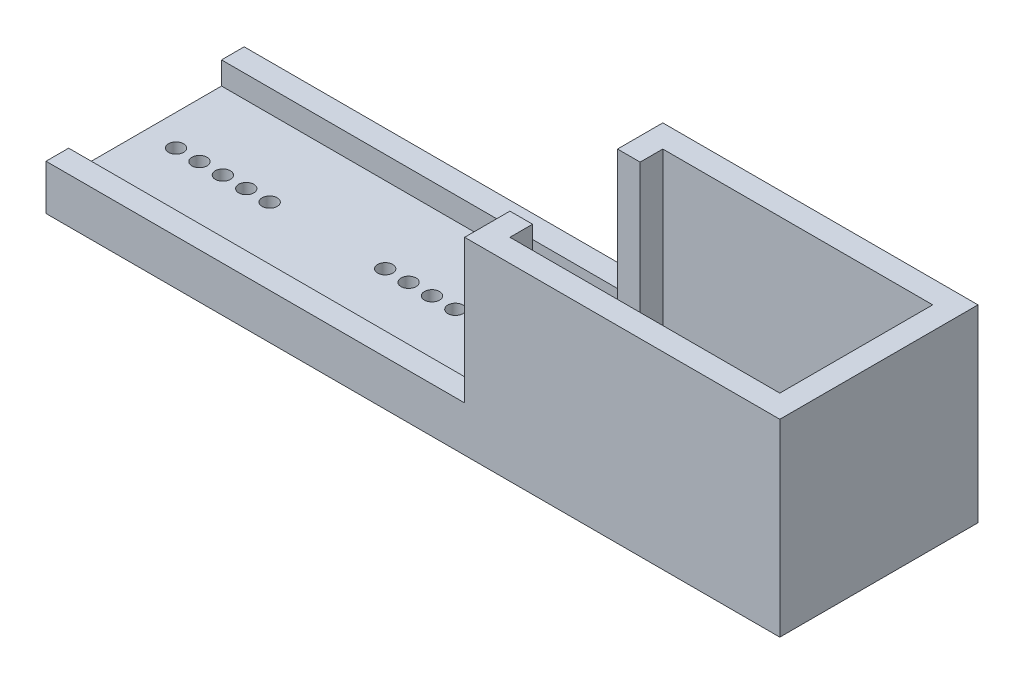
ISO-10303-21;
HEADER;
FILE_DESCRIPTION(('STEP AP214'),'2;1');
FILE_NAME('part.step','',(''),(''),'','','');
FILE_SCHEMA(('AUTOMOTIVE_DESIGN { 1 0 10303 214 1 1 1 1 }'));
ENDSEC;
DATA;
#1=APPLICATION_CONTEXT('core data for automotive mechanical design processes');
#2=APPLICATION_PROTOCOL_DEFINITION('international standard','automotive_design',2000,#1);
#3=PRODUCT_CONTEXT('',#1,'mechanical');
#4=PRODUCT('Part','Part','',(#3));
#5=PRODUCT_RELATED_PRODUCT_CATEGORY('part','',(#4));
#6=PRODUCT_DEFINITION_FORMATION('','',#4);
#7=PRODUCT_DEFINITION_CONTEXT('part definition',#1,'design');
#8=PRODUCT_DEFINITION('design','',#6,#7);
#9=PRODUCT_DEFINITION_SHAPE('','',#8);
#10=(LENGTH_UNIT() NAMED_UNIT(*) SI_UNIT(.MILLI.,.METRE.));
#11=(NAMED_UNIT(*) PLANE_ANGLE_UNIT() SI_UNIT($,.RADIAN.));
#12=(NAMED_UNIT(*) SI_UNIT($,.STERADIAN.) SOLID_ANGLE_UNIT());
#13=UNCERTAINTY_MEASURE_WITH_UNIT(LENGTH_MEASURE(1.E-05),#10,'distance_accuracy_value','');
#14=(GEOMETRIC_REPRESENTATION_CONTEXT(3) GLOBAL_UNCERTAINTY_ASSIGNED_CONTEXT((#13)) GLOBAL_UNIT_ASSIGNED_CONTEXT((#10,
#11,#12)) REPRESENTATION_CONTEXT('',''));
#15=CARTESIAN_POINT('',(0.,0.,0.));
#16=DIRECTION('',(0.,0.,1.));
#17=DIRECTION('',(1.,0.,0.));
#18=AXIS2_PLACEMENT_3D('',#15,#16,#17);
#19=CARTESIAN_POINT('',(0.,3.,0.));
#20=DIRECTION('',(0.,-1.,0.));
#21=DIRECTION('',(0.,0.,-1.));
#22=AXIS2_PLACEMENT_3D('',#19,#20,#21);
#23=PLANE('',#22);
#24=CARTESIAN_POINT('',(-44.5,3.,0.));
#25=DIRECTION('',(0.,1.,0.));
#26=DIRECTION('',(0.,0.,1.));
#27=AXIS2_PLACEMENT_3D('',#24,#25,#26);
#28=CIRCLE('',#27,0.999999999999998);
#29=CARTESIAN_POINT('',(-44.5,3.,1.00000000000009));
#30=VERTEX_POINT('',#29);
#31=EDGE_CURVE('E259',#30,#30,#28,.T.);
#32=ORIENTED_EDGE('',*,*,#31,.F.);
#33=EDGE_LOOP('',(#32));
#34=FACE_BOUND('',#33,.T.);
#35=CARTESIAN_POINT('',(-16.8,3.,0.));
#36=DIRECTION('',(0.,1.,0.));
#37=DIRECTION('',(0.,0.,1.));
#38=AXIS2_PLACEMENT_3D('',#35,#36,#37);
#39=CIRCLE('',#38,1.);
#40=CARTESIAN_POINT('',(-16.8,3.,1.));
#41=VERTEX_POINT('',#40);
#42=EDGE_CURVE('E299',#41,#41,#39,.T.);
#43=ORIENTED_EDGE('',*,*,#42,.F.);
#44=EDGE_LOOP('',(#43));
#45=FACE_BOUND('',#44,.T.);
#46=CARTESIAN_POINT('',(-13.7,3.,0.));
#47=DIRECTION('',(0.,1.,0.));
#48=DIRECTION('',(0.,0.,1.));
#49=AXIS2_PLACEMENT_3D('',#46,#47,#48);
#50=CIRCLE('',#49,1.);
#51=CARTESIAN_POINT('',(-13.7,3.,1.));
#52=VERTEX_POINT('',#51);
#53=EDGE_CURVE('E307',#52,#52,#50,.T.);
#54=ORIENTED_EDGE('',*,*,#53,.F.);
#55=EDGE_LOOP('',(#54));
#56=FACE_BOUND('',#55,.T.);
#57=CARTESIAN_POINT('',(-10.6,3.,0.));
#58=DIRECTION('',(0.,1.,0.));
#59=DIRECTION('',(0.,0.,1.));
#60=AXIS2_PLACEMENT_3D('',#57,#58,#59);
#61=CIRCLE('',#60,1.);
#62=CARTESIAN_POINT('',(-10.6,3.,1.));
#63=VERTEX_POINT('',#62);
#64=EDGE_CURVE('E315',#63,#63,#61,.T.);
#65=ORIENTED_EDGE('',*,*,#64,.F.);
#66=EDGE_LOOP('',(#65));
#67=FACE_BOUND('',#66,.T.);
#68=CARTESIAN_POINT('',(-7.49999999999999,3.,0.));
#69=DIRECTION('',(0.,1.,0.));
#70=DIRECTION('',(0.,0.,1.));
#71=AXIS2_PLACEMENT_3D('',#68,#69,#70);
#72=CIRCLE('',#71,1.);
#73=CARTESIAN_POINT('',(-7.49999999999999,3.,1.));
#74=VERTEX_POINT('',#73);
#75=EDGE_CURVE('E264',#74,#74,#72,.T.);
#76=ORIENTED_EDGE('',*,*,#75,.F.);
#77=EDGE_LOOP('',(#76));
#78=FACE_BOUND('',#77,.T.);
#79=CARTESIAN_POINT('',(-4.39999999999999,3.,0.));
#80=DIRECTION('',(0.,1.,0.));
#81=DIRECTION('',(0.,0.,1.));
#82=AXIS2_PLACEMENT_3D('',#79,#80,#81);
#83=CIRCLE('',#82,1.);
#84=CARTESIAN_POINT('',(-4.39999999999999,3.,1.));
#85=VERTEX_POINT('',#84);
#86=EDGE_CURVE('E265',#85,#85,#83,.T.);
#87=ORIENTED_EDGE('',*,*,#86,.F.);
#88=EDGE_LOOP('',(#87));
#89=FACE_BOUND('',#88,.T.);
#90=CARTESIAN_POINT('',(-35.2,3.,0.));
#91=DIRECTION('',(0.,1.,0.));
#92=DIRECTION('',(0.,0.,1.));
#93=AXIS2_PLACEMENT_3D('',#90,#91,#92);
#94=CIRCLE('',#93,0.999999999999998);
#95=CARTESIAN_POINT('',(-35.2,3.,1.00000000000002));
#96=VERTEX_POINT('',#95);
#97=EDGE_CURVE('E273',#96,#96,#94,.T.);
#98=ORIENTED_EDGE('',*,*,#97,.F.);
#99=EDGE_LOOP('',(#98));
#100=FACE_BOUND('',#99,.T.);
#101=CARTESIAN_POINT('',(-38.3,3.,0.));
#102=DIRECTION('',(0.,1.,0.));
#103=DIRECTION('',(0.,0.,1.));
#104=AXIS2_PLACEMENT_3D('',#101,#102,#103);
#105=CIRCLE('',#104,0.999999999999998);
#106=CARTESIAN_POINT('',(-38.3,3.,1.00000000000004));
#107=VERTEX_POINT('',#106);
#108=EDGE_CURVE('E281',#107,#107,#105,.T.);
#109=ORIENTED_EDGE('',*,*,#108,.F.);
#110=EDGE_LOOP('',(#109));
#111=FACE_BOUND('',#110,.T.);
#112=CARTESIAN_POINT('',(-41.4,3.,0.));
#113=DIRECTION('',(0.,1.,0.));
#114=DIRECTION('',(0.,0.,1.));
#115=AXIS2_PLACEMENT_3D('',#112,#113,#114);
#116=CIRCLE('',#115,0.999999999999998);
#117=CARTESIAN_POINT('',(-41.4,3.,1.00000000000007));
#118=VERTEX_POINT('',#117);
#119=EDGE_CURVE('E289',#118,#118,#116,.T.);
#120=ORIENTED_EDGE('',*,*,#119,.F.);
#121=EDGE_LOOP('',(#120));
#122=FACE_BOUND('',#121,.T.);
#123=CARTESIAN_POINT('',(-32.1,3.,0.));
#124=DIRECTION('',(0.,1.,0.));
#125=DIRECTION('',(0.,0.,1.));
#126=AXIS2_PLACEMENT_3D('',#123,#124,#125);
#127=CIRCLE('',#126,1.);
#128=CARTESIAN_POINT('',(-32.1,3.,1.));
#129=VERTEX_POINT('',#128);
#130=EDGE_CURVE('E298',#129,#129,#127,.T.);
#131=ORIENTED_EDGE('',*,*,#130,.F.);
#132=EDGE_LOOP('',(#131));
#133=FACE_BOUND('',#132,.T.);
#134=DIRECTION('',(-1.,0.,0.));
#135=VECTOR('',#134,1.);
#136=CARTESIAN_POINT('',(-48.6,3.,10.125));
#137=LINE('',#136,#135);
#138=CARTESIAN_POINT('',(6.85,3.,10.125));
#139=VERTEX_POINT('',#138);
#140=CARTESIAN_POINT('',(-48.6,3.,10.125));
#141=VERTEX_POINT('',#140);
#142=EDGE_CURVE('E218',#139,#141,#137,.T.);
#143=ORIENTED_EDGE('',*,*,#142,.F.);
#144=DIRECTION('',(0.,0.,1.));
#145=VECTOR('',#144,1.);
#146=CARTESIAN_POINT('',(6.85,3.,7.12500000000001));
#147=LINE('',#146,#145);
#148=CARTESIAN_POINT('',(6.85,3.,7.12500000000001));
#149=VERTEX_POINT('',#148);
#150=EDGE_CURVE('E381',#149,#139,#147,.T.);
#151=ORIENTED_EDGE('',*,*,#150,.F.);
#152=DIRECTION('',(-1.,0.,0.));
#153=VECTOR('',#152,1.);
#154=CARTESIAN_POINT('',(9.85,3.,7.12500000000001));
#155=LINE('',#154,#153);
#156=CARTESIAN_POINT('',(9.85,3.,7.12500000000001));
#157=VERTEX_POINT('',#156);
#158=EDGE_CURVE('E443',#157,#149,#155,.T.);
#159=ORIENTED_EDGE('',*,*,#158,.F.);
#160=DIRECTION('',(0.,0.,-1.));
#161=VECTOR('',#160,1.);
#162=CARTESIAN_POINT('',(9.85,3.,10.125));
#163=LINE('',#162,#161);
#164=CARTESIAN_POINT('',(9.85,3.,10.125));
#165=VERTEX_POINT('',#164);
#166=EDGE_CURVE('E439',#165,#157,#163,.T.);
#167=ORIENTED_EDGE('',*,*,#166,.F.);
#168=DIRECTION('',(-1.,0.,0.));
#169=VECTOR('',#168,1.);
#170=CARTESIAN_POINT('',(45.6,3.,10.125));
#171=LINE('',#170,#169);
#172=CARTESIAN_POINT('',(14.35,3.,10.125));
#173=VERTEX_POINT('',#172);
#174=EDGE_CURVE('E434',#173,#165,#171,.T.);
#175=ORIENTED_EDGE('',*,*,#174,.F.);
#176=DIRECTION('',(0.,0.,1.));
#177=VECTOR('',#176,1.);
#178=CARTESIAN_POINT('',(14.35,3.,-10.125));
#179=LINE('',#178,#177);
#180=CARTESIAN_POINT('',(14.35,3.,-10.125));
#181=VERTEX_POINT('',#180);
#182=EDGE_CURVE('E336',#181,#173,#179,.T.);
#183=ORIENTED_EDGE('',*,*,#182,.F.);
#184=DIRECTION('',(1.,0.,0.));
#185=VECTOR('',#184,1.);
#186=CARTESIAN_POINT('',(45.6,3.,-10.125));
#187=LINE('',#186,#185);
#188=CARTESIAN_POINT('',(9.85,3.,-10.125));
#189=VERTEX_POINT('',#188);
#190=EDGE_CURVE('E426',#189,#181,#187,.T.);
#191=ORIENTED_EDGE('',*,*,#190,.F.);
#192=DIRECTION('',(0.,0.,-1.));
#193=VECTOR('',#192,1.);
#194=CARTESIAN_POINT('',(9.85,3.,-10.125));
#195=LINE('',#194,#193);
#196=CARTESIAN_POINT('',(9.85,3.,-7.125));
#197=VERTEX_POINT('',#196);
#198=EDGE_CURVE('E421',#197,#189,#195,.T.);
#199=ORIENTED_EDGE('',*,*,#198,.F.);
#200=DIRECTION('',(1.,0.,0.));
#201=VECTOR('',#200,1.);
#202=CARTESIAN_POINT('',(9.85,3.,-7.125));
#203=LINE('',#202,#201);
#204=CARTESIAN_POINT('',(6.85,3.,-7.125));
#205=VERTEX_POINT('',#204);
#206=EDGE_CURVE('E417',#205,#197,#203,.T.);
#207=ORIENTED_EDGE('',*,*,#206,.F.);
#208=DIRECTION('',(0.,0.,1.));
#209=VECTOR('',#208,1.);
#210=CARTESIAN_POINT('',(6.85,3.,-7.125));
#211=LINE('',#210,#209);
#212=CARTESIAN_POINT('',(6.85,3.,-10.125));
#213=VERTEX_POINT('',#212);
#214=EDGE_CURVE('E366',#213,#205,#211,.T.);
#215=ORIENTED_EDGE('',*,*,#214,.F.);
#216=DIRECTION('',(1.,0.,0.));
#217=VECTOR('',#216,1.);
#218=CARTESIAN_POINT('',(-48.6,3.,-10.125));
#219=LINE('',#218,#217);
#220=CARTESIAN_POINT('',(-48.6,3.,-10.125));
#221=VERTEX_POINT('',#220);
#222=EDGE_CURVE('E234',#221,#213,#219,.T.);
#223=ORIENTED_EDGE('',*,*,#222,.F.);
#224=DIRECTION('',(0.,0.,1.));
#225=VECTOR('',#224,1.);
#226=CARTESIAN_POINT('',(-48.6,3.,13.125));
#227=LINE('',#226,#225);
#228=EDGE_CURVE('E55',#221,#141,#227,.T.);
#229=ORIENTED_EDGE('',*,*,#228,.T.);
#230=EDGE_LOOP('',(#143,#151,#159,#167,#175,#183,#191,#199,#207,#215,#223,#229));
#231=FACE_BOUND('',#230,.T.);
#232=ADVANCED_FACE('F39',(#34,#45,#56,#67,#78,#89,#100,#111,#122,#133,#231),#23,.F.);
#233=CARTESIAN_POINT('',(6.85,25.,7.12500000000001));
#234=DIRECTION('',(1.,0.,0.));
#235=DIRECTION('',(0.,0.,-1.));
#236=AXIS2_PLACEMENT_3D('',#233,#234,#235);
#237=PLANE('',#236);
#238=DIRECTION('',(0.,-1.,0.));
#239=VECTOR('',#238,1.);
#240=CARTESIAN_POINT('',(6.85,6.,10.125));
#241=LINE('',#240,#239);
#242=CARTESIAN_POINT('',(6.85,6.,10.125));
#243=VERTEX_POINT('',#242);
#244=EDGE_CURVE('E230',#243,#139,#241,.T.);
#245=ORIENTED_EDGE('',*,*,#244,.F.);
#246=DIRECTION('',(0.,0.,-1.));
#247=VECTOR('',#246,1.);
#248=CARTESIAN_POINT('',(6.85,6.,13.125));
#249=LINE('',#248,#247);
#250=CARTESIAN_POINT('',(6.85,6.,13.125));
#251=VERTEX_POINT('',#250);
#252=EDGE_CURVE('E63',#251,#243,#249,.T.);
#253=ORIENTED_EDGE('',*,*,#252,.F.);
#254=DIRECTION('',(0.,-1.,0.));
#255=VECTOR('',#254,1.);
#256=CARTESIAN_POINT('',(6.85,25.,13.125));
#257=LINE('',#256,#255);
#258=CARTESIAN_POINT('',(6.85,25.,13.125));
#259=VERTEX_POINT('',#258);
#260=EDGE_CURVE('E209',#259,#251,#257,.T.);
#261=ORIENTED_EDGE('',*,*,#260,.F.);
#262=DIRECTION('',(0.,0.,1.));
#263=VECTOR('',#262,1.);
#264=CARTESIAN_POINT('',(6.85,25.,7.12500000000001));
#265=LINE('',#264,#263);
#266=CARTESIAN_POINT('',(6.85,25.,7.12500000000001));
#267=VERTEX_POINT('',#266);
#268=EDGE_CURVE('E408',#267,#259,#265,.T.);
#269=ORIENTED_EDGE('',*,*,#268,.F.);
#270=DIRECTION('',(0.,-1.,0.));
#271=VECTOR('',#270,1.);
#272=CARTESIAN_POINT('',(6.85,25.,7.12500000000001));
#273=LINE('',#272,#271);
#274=EDGE_CURVE('E452',#267,#149,#273,.T.);
#275=ORIENTED_EDGE('',*,*,#274,.T.);
#276=ORIENTED_EDGE('',*,*,#150,.T.);
#277=EDGE_LOOP('',(#245,#253,#261,#269,#275,#276));
#278=FACE_BOUND('',#277,.T.);
#279=ADVANCED_FACE('F521',(#278),#237,.F.);
#280=CARTESIAN_POINT('',(6.85,25.,-7.125));
#281=DIRECTION('',(1.,0.,0.));
#282=DIRECTION('',(0.,0.,-1.));
#283=AXIS2_PLACEMENT_3D('',#280,#281,#282);
#284=PLANE('',#283);
#285=DIRECTION('',(0.,-1.,0.));
#286=VECTOR('',#285,1.);
#287=CARTESIAN_POINT('',(6.85,6.,-10.125));
#288=LINE('',#287,#286);
#289=CARTESIAN_POINT('',(6.85,6.,-10.125));
#290=VERTEX_POINT('',#289);
#291=EDGE_CURVE('E250',#290,#213,#288,.T.);
#292=ORIENTED_EDGE('',*,*,#291,.T.);
#293=ORIENTED_EDGE('',*,*,#214,.T.);
#294=DIRECTION('',(0.,-1.,0.));
#295=VECTOR('',#294,1.);
#296=CARTESIAN_POINT('',(6.85,25.,-7.125));
#297=LINE('',#296,#295);
#298=CARTESIAN_POINT('',(6.85,25.,-7.125));
#299=VERTEX_POINT('',#298);
#300=EDGE_CURVE('E480',#299,#205,#297,.T.);
#301=ORIENTED_EDGE('',*,*,#300,.F.);
#302=DIRECTION('',(0.,0.,1.));
#303=VECTOR('',#302,1.);
#304=CARTESIAN_POINT('',(6.85,25.,-7.125));
#305=LINE('',#304,#303);
#306=CARTESIAN_POINT('',(6.85,25.,-13.125));
#307=VERTEX_POINT('',#306);
#308=EDGE_CURVE('E384',#307,#299,#305,.T.);
#309=ORIENTED_EDGE('',*,*,#308,.F.);
#310=DIRECTION('',(0.,-1.,0.));
#311=VECTOR('',#310,1.);
#312=CARTESIAN_POINT('',(6.85,25.,-13.125));
#313=LINE('',#312,#311);
#314=CARTESIAN_POINT('',(6.85,6.,-13.125));
#315=VERTEX_POINT('',#314);
#316=EDGE_CURVE('E484',#307,#315,#313,.T.);
#317=ORIENTED_EDGE('',*,*,#316,.T.);
#318=DIRECTION('',(0.,0.,-1.));
#319=VECTOR('',#318,1.);
#320=CARTESIAN_POINT('',(6.85,6.,-13.125));
#321=LINE('',#320,#319);
#322=EDGE_CURVE('E243',#290,#315,#321,.T.);
#323=ORIENTED_EDGE('',*,*,#322,.F.);
#324=EDGE_LOOP('',(#292,#293,#301,#309,#317,#323));
#325=FACE_BOUND('',#324,.T.);
#326=ADVANCED_FACE('F523',(#325),#284,.F.);
#327=CARTESIAN_POINT('',(20.85,3.,-10.125));
#328=VERTEX_POINT('',#327);
#329=CARTESIAN_POINT('',(45.6,3.,-10.125));
#330=VERTEX_POINT('',#329);
#331=EDGE_CURVE('E425',#328,#330,#187,.T.);
#332=ORIENTED_EDGE('',*,*,#331,.F.);
#333=DIRECTION('',(0.,0.,-1.));
#334=VECTOR('',#333,1.);
#335=CARTESIAN_POINT('',(20.85,3.,-10.125));
#336=LINE('',#335,#334);
#337=CARTESIAN_POINT('',(20.85,3.,10.125));
#338=VERTEX_POINT('',#337);
#339=EDGE_CURVE('E345',#338,#328,#336,.T.);
#340=ORIENTED_EDGE('',*,*,#339,.F.);
#341=CARTESIAN_POINT('',(45.6,3.,10.125));
#342=VERTEX_POINT('',#341);
#343=EDGE_CURVE('E435',#342,#338,#171,.T.);
#344=ORIENTED_EDGE('',*,*,#343,.F.);
#345=DIRECTION('',(0.,0.,1.));
#346=VECTOR('',#345,1.);
#347=CARTESIAN_POINT('',(45.6,3.,10.125));
#348=LINE('',#347,#346);
#349=EDGE_CURVE('E430',#330,#342,#348,.T.);
#350=ORIENTED_EDGE('',*,*,#349,.F.);
#351=EDGE_LOOP('',(#332,#340,#344,#350));
#352=FACE_BOUND('',#351,.T.);
#353=ADVANCED_FACE('F529',(#352),#23,.F.);
#354=CARTESIAN_POINT('',(48.6,3.,13.125));
#355=DIRECTION('',(-1.,0.,0.));
#356=DIRECTION('',(0.,0.,1.));
#357=AXIS2_PLACEMENT_3D('',#354,#355,#356);
#358=PLANE('',#357);
#359=DIRECTION('',(0.,0.,-1.));
#360=VECTOR('',#359,1.);
#361=CARTESIAN_POINT('',(48.6,0.,13.125));
#362=LINE('',#361,#360);
#363=CARTESIAN_POINT('',(48.6,0.,13.125));
#364=VERTEX_POINT('',#363);
#365=CARTESIAN_POINT('',(48.6,0.,-13.125));
#366=VERTEX_POINT('',#365);
#367=EDGE_CURVE('E488',#364,#366,#362,.T.);
#368=ORIENTED_EDGE('',*,*,#367,.T.);
#369=DIRECTION('',(0.,-1.,0.));
#370=VECTOR('',#369,1.);
#371=CARTESIAN_POINT('',(48.6,3.,-13.125));
#372=LINE('',#371,#370);
#373=CARTESIAN_POINT('',(48.6,25.,-13.125));
#374=VERTEX_POINT('',#373);
#375=EDGE_CURVE('E11',#374,#366,#372,.T.);
#376=ORIENTED_EDGE('',*,*,#375,.F.);
#377=DIRECTION('',(0.,0.,-1.));
#378=VECTOR('',#377,1.);
#379=CARTESIAN_POINT('',(48.6,25.,13.125));
#380=LINE('',#379,#378);
#381=CARTESIAN_POINT('',(48.6,25.,13.125));
#382=VERTEX_POINT('',#381);
#383=EDGE_CURVE('E376',#382,#374,#380,.T.);
#384=ORIENTED_EDGE('',*,*,#383,.F.);
#385=DIRECTION('',(0.,-1.,0.));
#386=VECTOR('',#385,1.);
#387=CARTESIAN_POINT('',(48.6,3.,13.125));
#388=LINE('',#387,#386);
#389=EDGE_CURVE('E203',#382,#364,#388,.T.);
#390=ORIENTED_EDGE('',*,*,#389,.T.);
#391=EDGE_LOOP('',(#368,#376,#384,#390));
#392=FACE_BOUND('',#391,.T.);
#393=ADVANCED_FACE('F41',(#392),#358,.F.);
#394=CARTESIAN_POINT('',(-48.6,3.,-13.125));
#395=DIRECTION('',(0.,0.,1.));
#396=DIRECTION('',(1.,0.,0.));
#397=AXIS2_PLACEMENT_3D('',#394,#395,#396);
#398=PLANE('',#397);
#399=DIRECTION('',(0.,-1.,0.));
#400=VECTOR('',#399,1.);
#401=CARTESIAN_POINT('',(-48.6,3.,-13.125));
#402=LINE('',#401,#400);
#403=CARTESIAN_POINT('',(-48.6,6.,-13.125));
#404=VERTEX_POINT('',#403);
#405=CARTESIAN_POINT('',(-48.6,0.,-13.125));
#406=VERTEX_POINT('',#405);
#407=EDGE_CURVE('E48',#404,#406,#402,.T.);
#408=ORIENTED_EDGE('',*,*,#407,.F.);
#409=DIRECTION('',(-1.,0.,0.));
#410=VECTOR('',#409,1.);
#411=CARTESIAN_POINT('',(-48.6,6.,-13.125));
#412=LINE('',#411,#410);
#413=EDGE_CURVE('E246',#315,#404,#412,.T.);
#414=ORIENTED_EDGE('',*,*,#413,.F.);
#415=ORIENTED_EDGE('',*,*,#316,.F.);
#416=DIRECTION('',(-1.,0.,0.));
#417=VECTOR('',#416,1.);
#418=CARTESIAN_POINT('',(48.6,25.,-13.125));
#419=LINE('',#418,#417);
#420=EDGE_CURVE('E380',#374,#307,#419,.T.);
#421=ORIENTED_EDGE('',*,*,#420,.F.);
#422=ORIENTED_EDGE('',*,*,#375,.T.);
#423=DIRECTION('',(-1.,0.,0.));
#424=VECTOR('',#423,1.);
#425=CARTESIAN_POINT('',(-48.6,0.,-13.125));
#426=LINE('',#425,#424);
#427=EDGE_CURVE('E495',#366,#406,#426,.T.);
#428=ORIENTED_EDGE('',*,*,#427,.T.);
#429=EDGE_LOOP('',(#408,#414,#415,#421,#422,#428));
#430=FACE_BOUND('',#429,.T.);
#431=ADVANCED_FACE('F573',(#430),#398,.F.);
#432=CARTESIAN_POINT('',(-48.6,3.,13.125));
#433=DIRECTION('',(1.,0.,0.));
#434=DIRECTION('',(0.,0.,-1.));
#435=AXIS2_PLACEMENT_3D('',#432,#433,#434);
#436=PLANE('',#435);
#437=DIRECTION('',(0.,0.,1.));
#438=VECTOR('',#437,1.);
#439=CARTESIAN_POINT('',(-48.6,0.,13.125));
#440=LINE('',#439,#438);
#441=CARTESIAN_POINT('',(-48.6,0.,13.125));
#442=VERTEX_POINT('',#441);
#443=EDGE_CURVE('E199',#406,#442,#440,.T.);
#444=ORIENTED_EDGE('',*,*,#443,.T.);
#445=DIRECTION('',(0.,-1.,0.));
#446=VECTOR('',#445,1.);
#447=CARTESIAN_POINT('',(-48.6,3.,13.125));
#448=LINE('',#447,#446);
#449=CARTESIAN_POINT('',(-48.6,6.,13.125));
#450=VERTEX_POINT('',#449);
#451=EDGE_CURVE('E191',#450,#442,#448,.T.);
#452=ORIENTED_EDGE('',*,*,#451,.F.);
#453=DIRECTION('',(0.,0.,1.));
#454=VECTOR('',#453,1.);
#455=CARTESIAN_POINT('',(-48.6,6.,13.125));
#456=LINE('',#455,#454);
#457=CARTESIAN_POINT('',(-48.6,6.,10.125));
#458=VERTEX_POINT('',#457);
#459=EDGE_CURVE('E196',#458,#450,#456,.T.);
#460=ORIENTED_EDGE('',*,*,#459,.F.);
#461=DIRECTION('',(0.,-1.,0.));
#462=VECTOR('',#461,1.);
#463=CARTESIAN_POINT('',(-48.6,6.,10.125));
#464=LINE('',#463,#462);
#465=EDGE_CURVE('E226',#458,#141,#464,.T.);
#466=ORIENTED_EDGE('',*,*,#465,.T.);
#467=ORIENTED_EDGE('',*,*,#228,.F.);
#468=DIRECTION('',(0.,-1.,0.));
#469=VECTOR('',#468,1.);
#470=CARTESIAN_POINT('',(-48.6,6.,-10.125));
#471=LINE('',#470,#469);
#472=CARTESIAN_POINT('',(-48.6,6.,-10.125));
#473=VERTEX_POINT('',#472);
#474=EDGE_CURVE('E256',#473,#221,#471,.T.);
#475=ORIENTED_EDGE('',*,*,#474,.F.);
#476=DIRECTION('',(0.,0.,1.));
#477=VECTOR('',#476,1.);
#478=CARTESIAN_POINT('',(-48.6,6.,-13.125));
#479=LINE('',#478,#477);
#480=EDGE_CURVE('E235',#404,#473,#479,.T.);
#481=ORIENTED_EDGE('',*,*,#480,.F.);
#482=ORIENTED_EDGE('',*,*,#407,.T.);
#483=EDGE_LOOP('',(#444,#452,#460,#466,#467,#475,#481,#482));
#484=FACE_BOUND('',#483,.T.);
#485=ADVANCED_FACE('F193',(#484),#436,.F.);
#486=CARTESIAN_POINT('',(-48.6,3.,13.125));
#487=DIRECTION('',(0.,0.,-1.));
#488=DIRECTION('',(-1.,0.,0.));
#489=AXIS2_PLACEMENT_3D('',#486,#487,#488);
#490=PLANE('',#489);
#491=DIRECTION('',(1.,0.,0.));
#492=VECTOR('',#491,1.);
#493=CARTESIAN_POINT('',(-48.6,0.,13.125));
#494=LINE('',#493,#492);
#495=EDGE_CURVE('E491',#442,#364,#494,.T.);
#496=ORIENTED_EDGE('',*,*,#495,.T.);
#497=ORIENTED_EDGE('',*,*,#389,.F.);
#498=DIRECTION('',(1.,0.,0.));
#499=VECTOR('',#498,1.);
#500=CARTESIAN_POINT('',(9.85,25.,13.125));
#501=LINE('',#500,#499);
#502=EDGE_CURVE('E411',#259,#382,#501,.T.);
#503=ORIENTED_EDGE('',*,*,#502,.F.);
#504=ORIENTED_EDGE('',*,*,#260,.T.);
#505=DIRECTION('',(1.,0.,0.));
#506=VECTOR('',#505,1.);
#507=CARTESIAN_POINT('',(-48.6,6.,13.125));
#508=LINE('',#507,#506);
#509=EDGE_CURVE('E206',#450,#251,#508,.T.);
#510=ORIENTED_EDGE('',*,*,#509,.F.);
#511=ORIENTED_EDGE('',*,*,#451,.T.);
#512=EDGE_LOOP('',(#496,#497,#503,#504,#510,#511));
#513=FACE_BOUND('',#512,.T.);
#514=ADVANCED_FACE('F207',(#513),#490,.F.);
#515=CARTESIAN_POINT('',(0.,0.,0.));
#516=DIRECTION('',(0.,-1.,0.));
#517=DIRECTION('',(0.,0.,-1.));
#518=AXIS2_PLACEMENT_3D('',#515,#516,#517);
#519=PLANE('',#518);
#520=CARTESIAN_POINT('',(-44.5,0.,0.));
#521=DIRECTION('',(0.,1.,0.));
#522=DIRECTION('',(0.,0.,1.));
#523=AXIS2_PLACEMENT_3D('',#520,#521,#522);
#524=CIRCLE('',#523,0.999999999999998);
#525=CARTESIAN_POINT('',(-44.5,0.,1.00000000000009));
#526=VERTEX_POINT('',#525);
#527=EDGE_CURVE('E293',#526,#526,#524,.T.);
#528=ORIENTED_EDGE('',*,*,#527,.T.);
#529=EDGE_LOOP('',(#528));
#530=FACE_BOUND('',#529,.T.);
#531=CARTESIAN_POINT('',(-16.8,0.,0.));
#532=DIRECTION('',(0.,1.,0.));
#533=DIRECTION('',(0.,0.,1.));
#534=AXIS2_PLACEMENT_3D('',#531,#532,#533);
#535=CIRCLE('',#534,1.);
#536=CARTESIAN_POINT('',(-16.8,0.,1.));
#537=VERTEX_POINT('',#536);
#538=EDGE_CURVE('E294',#537,#537,#535,.T.);
#539=ORIENTED_EDGE('',*,*,#538,.T.);
#540=EDGE_LOOP('',(#539));
#541=FACE_BOUND('',#540,.T.);
#542=CARTESIAN_POINT('',(-13.7,0.,0.));
#543=DIRECTION('',(0.,1.,0.));
#544=DIRECTION('',(0.,0.,1.));
#545=AXIS2_PLACEMENT_3D('',#542,#543,#544);
#546=CIRCLE('',#545,1.);
#547=CARTESIAN_POINT('',(-13.7,0.,1.));
#548=VERTEX_POINT('',#547);
#549=EDGE_CURVE('E303',#548,#548,#546,.T.);
#550=ORIENTED_EDGE('',*,*,#549,.T.);
#551=EDGE_LOOP('',(#550));
#552=FACE_BOUND('',#551,.T.);
#553=CARTESIAN_POINT('',(-10.6,0.,0.));
#554=DIRECTION('',(0.,1.,0.));
#555=DIRECTION('',(0.,0.,1.));
#556=AXIS2_PLACEMENT_3D('',#553,#554,#555);
#557=CIRCLE('',#556,1.);
#558=CARTESIAN_POINT('',(-10.6,0.,1.));
#559=VERTEX_POINT('',#558);
#560=EDGE_CURVE('E311',#559,#559,#557,.T.);
#561=ORIENTED_EDGE('',*,*,#560,.T.);
#562=EDGE_LOOP('',(#561));
#563=FACE_BOUND('',#562,.T.);
#564=CARTESIAN_POINT('',(-7.49999999999999,0.,0.));
#565=DIRECTION('',(0.,1.,0.));
#566=DIRECTION('',(0.,0.,1.));
#567=AXIS2_PLACEMENT_3D('',#564,#565,#566);
#568=CIRCLE('',#567,1.);
#569=CARTESIAN_POINT('',(-7.49999999999999,0.,1.));
#570=VERTEX_POINT('',#569);
#571=EDGE_CURVE('E319',#570,#570,#568,.T.);
#572=ORIENTED_EDGE('',*,*,#571,.T.);
#573=EDGE_LOOP('',(#572));
#574=FACE_BOUND('',#573,.T.);
#575=CARTESIAN_POINT('',(-4.39999999999999,0.,0.));
#576=DIRECTION('',(0.,1.,0.));
#577=DIRECTION('',(0.,0.,1.));
#578=AXIS2_PLACEMENT_3D('',#575,#576,#577);
#579=CIRCLE('',#578,1.);
#580=CARTESIAN_POINT('',(-4.39999999999999,0.,1.));
#581=VERTEX_POINT('',#580);
#582=EDGE_CURVE('E260',#581,#581,#579,.T.);
#583=ORIENTED_EDGE('',*,*,#582,.T.);
#584=EDGE_LOOP('',(#583));
#585=FACE_BOUND('',#584,.T.);
#586=CARTESIAN_POINT('',(-35.2,0.,0.));
#587=DIRECTION('',(0.,1.,0.));
#588=DIRECTION('',(0.,0.,1.));
#589=AXIS2_PLACEMENT_3D('',#586,#587,#588);
#590=CIRCLE('',#589,0.999999999999998);
#591=CARTESIAN_POINT('',(-35.2,0.,1.00000000000002));
#592=VERTEX_POINT('',#591);
#593=EDGE_CURVE('E269',#592,#592,#590,.T.);
#594=ORIENTED_EDGE('',*,*,#593,.T.);
#595=EDGE_LOOP('',(#594));
#596=FACE_BOUND('',#595,.T.);
#597=CARTESIAN_POINT('',(-38.3,0.,0.));
#598=DIRECTION('',(0.,1.,0.));
#599=DIRECTION('',(0.,0.,1.));
#600=AXIS2_PLACEMENT_3D('',#597,#598,#599);
#601=CIRCLE('',#600,0.999999999999998);
#602=CARTESIAN_POINT('',(-38.3,0.,1.00000000000004));
#603=VERTEX_POINT('',#602);
#604=EDGE_CURVE('E277',#603,#603,#601,.T.);
#605=ORIENTED_EDGE('',*,*,#604,.T.);
#606=EDGE_LOOP('',(#605));
#607=FACE_BOUND('',#606,.T.);
#608=CARTESIAN_POINT('',(-41.4,0.,0.));
#609=DIRECTION('',(0.,1.,0.));
#610=DIRECTION('',(0.,0.,1.));
#611=AXIS2_PLACEMENT_3D('',#608,#609,#610);
#612=CIRCLE('',#611,0.999999999999998);
#613=CARTESIAN_POINT('',(-41.4,0.,1.00000000000007));
#614=VERTEX_POINT('',#613);
#615=EDGE_CURVE('E285',#614,#614,#612,.T.);
#616=ORIENTED_EDGE('',*,*,#615,.T.);
#617=EDGE_LOOP('',(#616));
#618=FACE_BOUND('',#617,.T.);
#619=CARTESIAN_POINT('',(-32.1,0.,0.));
#620=DIRECTION('',(0.,1.,0.));
#621=DIRECTION('',(0.,0.,1.));
#622=AXIS2_PLACEMENT_3D('',#619,#620,#621);
#623=CIRCLE('',#622,1.);
#624=CARTESIAN_POINT('',(-32.1,0.,1.));
#625=VERTEX_POINT('',#624);
#626=EDGE_CURVE('E332',#625,#625,#623,.T.);
#627=ORIENTED_EDGE('',*,*,#626,.T.);
#628=EDGE_LOOP('',(#627));
#629=FACE_BOUND('',#628,.T.);
#630=DIRECTION('',(0.,0.,1.));
#631=VECTOR('',#630,1.);
#632=CARTESIAN_POINT('',(14.35,0.,-10.125));
#633=LINE('',#632,#631);
#634=CARTESIAN_POINT('',(14.35,0.,-10.125));
#635=VERTEX_POINT('',#634);
#636=CARTESIAN_POINT('',(14.35,0.,10.125));
#637=VERTEX_POINT('',#636);
#638=EDGE_CURVE('E340',#635,#637,#633,.T.);
#639=ORIENTED_EDGE('',*,*,#638,.T.);
#640=DIRECTION('',(1.,0.,0.));
#641=VECTOR('',#640,1.);
#642=CARTESIAN_POINT('',(14.35,0.,10.125));
#643=LINE('',#642,#641);
#644=CARTESIAN_POINT('',(20.85,0.,10.125));
#645=VERTEX_POINT('',#644);
#646=EDGE_CURVE('E344',#637,#645,#643,.T.);
#647=ORIENTED_EDGE('',*,*,#646,.T.);
#648=DIRECTION('',(0.,0.,-1.));
#649=VECTOR('',#648,1.);
#650=CARTESIAN_POINT('',(20.85,0.,-10.125));
#651=LINE('',#650,#649);
#652=CARTESIAN_POINT('',(20.85,0.,-10.125));
#653=VERTEX_POINT('',#652);
#654=EDGE_CURVE('E349',#645,#653,#651,.T.);
#655=ORIENTED_EDGE('',*,*,#654,.T.);
#656=DIRECTION('',(-1.,0.,0.));
#657=VECTOR('',#656,1.);
#658=CARTESIAN_POINT('',(14.35,0.,-10.125));
#659=LINE('',#658,#657);
#660=EDGE_CURVE('E353',#653,#635,#659,.T.);
#661=ORIENTED_EDGE('',*,*,#660,.T.);
#662=EDGE_LOOP('',(#639,#647,#655,#661));
#663=FACE_BOUND('',#662,.T.);
#664=ORIENTED_EDGE('',*,*,#367,.F.);
#665=ORIENTED_EDGE('',*,*,#495,.F.);
#666=ORIENTED_EDGE('',*,*,#443,.F.);
#667=ORIENTED_EDGE('',*,*,#427,.F.);
#668=EDGE_LOOP('',(#664,#665,#666,#667));
#669=FACE_BOUND('',#668,.T.);
#670=ADVANCED_FACE('F511',(#530,#541,#552,#563,#574,#585,#596,#607,#618,#629,#663,#669),#519,.T.);
#671=CARTESIAN_POINT('',(9.85,25.,-7.125));
#672=DIRECTION('',(0.,0.,-1.));
#673=DIRECTION('',(-1.,0.,0.));
#674=AXIS2_PLACEMENT_3D('',#671,#672,#673);
#675=PLANE('',#674);
#676=ORIENTED_EDGE('',*,*,#206,.T.);
#677=DIRECTION('',(0.,-1.,0.));
#678=VECTOR('',#677,1.);
#679=CARTESIAN_POINT('',(9.85,25.,-7.125));
#680=LINE('',#679,#678);
#681=CARTESIAN_POINT('',(9.85,25.,-7.125));
#682=VERTEX_POINT('',#681);
#683=EDGE_CURVE('E476',#682,#197,#680,.T.);
#684=ORIENTED_EDGE('',*,*,#683,.F.);
#685=DIRECTION('',(1.,0.,0.));
#686=VECTOR('',#685,1.);
#687=CARTESIAN_POINT('',(9.85,25.,-7.125));
#688=LINE('',#687,#686);
#689=EDGE_CURVE('E387',#299,#682,#688,.T.);
#690=ORIENTED_EDGE('',*,*,#689,.F.);
#691=ORIENTED_EDGE('',*,*,#300,.T.);
#692=EDGE_LOOP('',(#676,#684,#690,#691));
#693=FACE_BOUND('',#692,.T.);
#694=ADVANCED_FACE('F560',(#693),#675,.F.);
#695=CARTESIAN_POINT('',(9.85,25.,-10.125));
#696=DIRECTION('',(-1.,0.,0.));
#697=DIRECTION('',(0.,0.,1.));
#698=AXIS2_PLACEMENT_3D('',#695,#696,#697);
#699=PLANE('',#698);
#700=ORIENTED_EDGE('',*,*,#198,.T.);
#701=DIRECTION('',(0.,-1.,0.));
#702=VECTOR('',#701,1.);
#703=CARTESIAN_POINT('',(9.85,25.,-10.125));
#704=LINE('',#703,#702);
#705=CARTESIAN_POINT('',(9.85,25.,-10.125));
#706=VERTEX_POINT('',#705);
#707=EDGE_CURVE('E472',#706,#189,#704,.T.);
#708=ORIENTED_EDGE('',*,*,#707,.F.);
#709=DIRECTION('',(0.,0.,-1.));
#710=VECTOR('',#709,1.);
#711=CARTESIAN_POINT('',(9.85,25.,-10.125));
#712=LINE('',#711,#710);
#713=EDGE_CURVE('E390',#682,#706,#712,.T.);
#714=ORIENTED_EDGE('',*,*,#713,.F.);
#715=ORIENTED_EDGE('',*,*,#683,.T.);
#716=EDGE_LOOP('',(#700,#708,#714,#715));
#717=FACE_BOUND('',#716,.T.);
#718=ADVANCED_FACE('F556',(#717),#699,.F.);
#719=CARTESIAN_POINT('',(45.6,25.,-10.125));
#720=DIRECTION('',(0.,0.,-1.));
#721=DIRECTION('',(-1.,0.,0.));
#722=AXIS2_PLACEMENT_3D('',#719,#720,#721);
#723=PLANE('',#722);
#724=ORIENTED_EDGE('',*,*,#190,.T.);
#725=DIRECTION('',(0.,1.,0.));
#726=VECTOR('',#725,1.);
#727=CARTESIAN_POINT('',(14.35,0.,-10.125));
#728=LINE('',#727,#726);
#729=EDGE_CURVE('E363',#635,#181,#728,.T.);
#730=ORIENTED_EDGE('',*,*,#729,.F.);
#731=ORIENTED_EDGE('',*,*,#660,.F.);
#732=DIRECTION('',(0.,1.,0.));
#733=VECTOR('',#732,1.);
#734=CARTESIAN_POINT('',(20.85,0.,-10.125));
#735=LINE('',#734,#733);
#736=EDGE_CURVE('E367',#653,#328,#735,.T.);
#737=ORIENTED_EDGE('',*,*,#736,.T.);
#738=ORIENTED_EDGE('',*,*,#331,.T.);
#739=DIRECTION('',(0.,-1.,0.));
#740=VECTOR('',#739,1.);
#741=CARTESIAN_POINT('',(45.6,25.,-10.125));
#742=LINE('',#741,#740);
#743=CARTESIAN_POINT('',(45.6,25.,-10.125));
#744=VERTEX_POINT('',#743);
#745=EDGE_CURVE('E468',#744,#330,#742,.T.);
#746=ORIENTED_EDGE('',*,*,#745,.F.);
#747=DIRECTION('',(1.,0.,0.));
#748=VECTOR('',#747,1.);
#749=CARTESIAN_POINT('',(45.6,25.,-10.125));
#750=LINE('',#749,#748);
#751=EDGE_CURVE('E393',#706,#744,#750,.T.);
#752=ORIENTED_EDGE('',*,*,#751,.F.);
#753=ORIENTED_EDGE('',*,*,#707,.T.);
#754=EDGE_LOOP('',(#724,#730,#731,#737,#738,#746,#752,#753));
#755=FACE_BOUND('',#754,.T.);
#756=ADVANCED_FACE('F552',(#755),#723,.F.);
#757=CARTESIAN_POINT('',(45.6,25.,10.125));
#758=DIRECTION('',(1.,0.,0.));
#759=DIRECTION('',(0.,0.,-1.));
#760=AXIS2_PLACEMENT_3D('',#757,#758,#759);
#761=PLANE('',#760);
#762=ORIENTED_EDGE('',*,*,#349,.T.);
#763=DIRECTION('',(0.,-1.,0.));
#764=VECTOR('',#763,1.);
#765=CARTESIAN_POINT('',(45.6,25.,10.125));
#766=LINE('',#765,#764);
#767=CARTESIAN_POINT('',(45.6,25.,10.125));
#768=VERTEX_POINT('',#767);
#769=EDGE_CURVE('E464',#768,#342,#766,.T.);
#770=ORIENTED_EDGE('',*,*,#769,.F.);
#771=DIRECTION('',(0.,0.,1.));
#772=VECTOR('',#771,1.);
#773=CARTESIAN_POINT('',(45.6,25.,10.125));
#774=LINE('',#773,#772);
#775=EDGE_CURVE('E396',#744,#768,#774,.T.);
#776=ORIENTED_EDGE('',*,*,#775,.F.);
#777=ORIENTED_EDGE('',*,*,#745,.T.);
#778=EDGE_LOOP('',(#762,#770,#776,#777));
#779=FACE_BOUND('',#778,.T.);
#780=ADVANCED_FACE('F548',(#779),#761,.F.);
#781=CARTESIAN_POINT('',(45.6,25.,10.125));
#782=DIRECTION('',(0.,0.,1.));
#783=DIRECTION('',(1.,0.,0.));
#784=AXIS2_PLACEMENT_3D('',#781,#782,#783);
#785=PLANE('',#784);
#786=ORIENTED_EDGE('',*,*,#343,.T.);
#787=DIRECTION('',(0.,1.,0.));
#788=VECTOR('',#787,1.);
#789=CARTESIAN_POINT('',(20.85,0.,10.125));
#790=LINE('',#789,#788);
#791=EDGE_CURVE('E370',#645,#338,#790,.T.);
#792=ORIENTED_EDGE('',*,*,#791,.F.);
#793=ORIENTED_EDGE('',*,*,#646,.F.);
#794=DIRECTION('',(0.,1.,0.));
#795=VECTOR('',#794,1.);
#796=CARTESIAN_POINT('',(14.35,0.,10.125));
#797=LINE('',#796,#795);
#798=EDGE_CURVE('E357',#637,#173,#797,.T.);
#799=ORIENTED_EDGE('',*,*,#798,.T.);
#800=ORIENTED_EDGE('',*,*,#174,.T.);
#801=DIRECTION('',(0.,-1.,0.));
#802=VECTOR('',#801,1.);
#803=CARTESIAN_POINT('',(9.85,25.,10.125));
#804=LINE('',#803,#802);
#805=CARTESIAN_POINT('',(9.85,25.,10.125));
#806=VERTEX_POINT('',#805);
#807=EDGE_CURVE('E460',#806,#165,#804,.T.);
#808=ORIENTED_EDGE('',*,*,#807,.F.);
#809=DIRECTION('',(-1.,0.,0.));
#810=VECTOR('',#809,1.);
#811=CARTESIAN_POINT('',(45.6,25.,10.125));
#812=LINE('',#811,#810);
#813=EDGE_CURVE('E399',#768,#806,#812,.T.);
#814=ORIENTED_EDGE('',*,*,#813,.F.);
#815=ORIENTED_EDGE('',*,*,#769,.T.);
#816=EDGE_LOOP('',(#786,#792,#793,#799,#800,#808,#814,#815));
#817=FACE_BOUND('',#816,.T.);
#818=ADVANCED_FACE('F544',(#817),#785,.F.);
#819=CARTESIAN_POINT('',(9.85,25.,10.125));
#820=DIRECTION('',(-1.,0.,0.));
#821=DIRECTION('',(0.,0.,1.));
#822=AXIS2_PLACEMENT_3D('',#819,#820,#821);
#823=PLANE('',#822);
#824=ORIENTED_EDGE('',*,*,#166,.T.);
#825=DIRECTION('',(0.,-1.,0.));
#826=VECTOR('',#825,1.);
#827=CARTESIAN_POINT('',(9.85,25.,7.12500000000001));
#828=LINE('',#827,#826);
#829=CARTESIAN_POINT('',(9.85,25.,7.12500000000001));
#830=VERTEX_POINT('',#829);
#831=EDGE_CURVE('E456',#830,#157,#828,.T.);
#832=ORIENTED_EDGE('',*,*,#831,.F.);
#833=DIRECTION('',(0.,0.,-1.));
#834=VECTOR('',#833,1.);
#835=CARTESIAN_POINT('',(9.85,25.,10.125));
#836=LINE('',#835,#834);
#837=EDGE_CURVE('E402',#806,#830,#836,.T.);
#838=ORIENTED_EDGE('',*,*,#837,.F.);
#839=ORIENTED_EDGE('',*,*,#807,.T.);
#840=EDGE_LOOP('',(#824,#832,#838,#839));
#841=FACE_BOUND('',#840,.T.);
#842=ADVANCED_FACE('F540',(#841),#823,.F.);
#843=CARTESIAN_POINT('',(9.85,25.,7.12500000000001));
#844=DIRECTION('',(0.,0.,1.));
#845=DIRECTION('',(1.,0.,0.));
#846=AXIS2_PLACEMENT_3D('',#843,#844,#845);
#847=PLANE('',#846);
#848=ORIENTED_EDGE('',*,*,#158,.T.);
#849=ORIENTED_EDGE('',*,*,#274,.F.);
#850=DIRECTION('',(-1.,0.,0.));
#851=VECTOR('',#850,1.);
#852=CARTESIAN_POINT('',(9.85,25.,7.12500000000001));
#853=LINE('',#852,#851);
#854=EDGE_CURVE('E405',#830,#267,#853,.T.);
#855=ORIENTED_EDGE('',*,*,#854,.F.);
#856=ORIENTED_EDGE('',*,*,#831,.T.);
#857=EDGE_LOOP('',(#848,#849,#855,#856));
#858=FACE_BOUND('',#857,.T.);
#859=ADVANCED_FACE('F537',(#858),#847,.F.);
#860=CARTESIAN_POINT('',(0.,25.,0.));
#861=DIRECTION('',(0.,1.,0.));
#862=DIRECTION('',(0.,0.,1.));
#863=AXIS2_PLACEMENT_3D('',#860,#861,#862);
#864=PLANE('',#863);
#865=ORIENTED_EDGE('',*,*,#383,.T.);
#866=ORIENTED_EDGE('',*,*,#420,.T.);
#867=ORIENTED_EDGE('',*,*,#308,.T.);
#868=ORIENTED_EDGE('',*,*,#689,.T.);
#869=ORIENTED_EDGE('',*,*,#713,.T.);
#870=ORIENTED_EDGE('',*,*,#751,.T.);
#871=ORIENTED_EDGE('',*,*,#775,.T.);
#872=ORIENTED_EDGE('',*,*,#813,.T.);
#873=ORIENTED_EDGE('',*,*,#837,.T.);
#874=ORIENTED_EDGE('',*,*,#854,.T.);
#875=ORIENTED_EDGE('',*,*,#268,.T.);
#876=ORIENTED_EDGE('',*,*,#502,.T.);
#877=EDGE_LOOP('',(#865,#866,#867,#868,#869,#870,#871,#872,#873,#874,#875,#876));
#878=FACE_BOUND('',#877,.T.);
#879=ADVANCED_FACE('F516',(#878),#864,.T.);
#880=CARTESIAN_POINT('',(14.35,0.,-10.125));
#881=DIRECTION('',(-1.,0.,0.));
#882=DIRECTION('',(0.,0.,1.));
#883=AXIS2_PLACEMENT_3D('',#880,#881,#882);
#884=PLANE('',#883);
#885=ORIENTED_EDGE('',*,*,#182,.T.);
#886=ORIENTED_EDGE('',*,*,#798,.F.);
#887=ORIENTED_EDGE('',*,*,#638,.F.);
#888=ORIENTED_EDGE('',*,*,#729,.T.);
#889=EDGE_LOOP('',(#885,#886,#887,#888));
#890=FACE_BOUND('',#889,.T.);
#891=ADVANCED_FACE('F700',(#890),#884,.F.);
#892=CARTESIAN_POINT('',(20.85,0.,-10.125));
#893=DIRECTION('',(1.,0.,0.));
#894=DIRECTION('',(0.,0.,-1.));
#895=AXIS2_PLACEMENT_3D('',#892,#893,#894);
#896=PLANE('',#895);
#897=ORIENTED_EDGE('',*,*,#339,.T.);
#898=ORIENTED_EDGE('',*,*,#736,.F.);
#899=ORIENTED_EDGE('',*,*,#654,.F.);
#900=ORIENTED_EDGE('',*,*,#791,.T.);
#901=EDGE_LOOP('',(#897,#898,#899,#900));
#902=FACE_BOUND('',#901,.T.);
#903=ADVANCED_FACE('F697',(#902),#896,.F.);
#904=CARTESIAN_POINT('',(-32.1,0.,0.));
#905=DIRECTION('',(0.,1.,0.));
#906=DIRECTION('',(0.,0.,1.));
#907=AXIS2_PLACEMENT_3D('',#904,#905,#906);
#908=CYLINDRICAL_SURFACE('',#907,1.);
#909=ORIENTED_EDGE('',*,*,#626,.F.);
#910=EDGE_LOOP('',(#909));
#911=FACE_BOUND('',#910,.T.);
#912=ORIENTED_EDGE('',*,*,#130,.T.);
#913=EDGE_LOOP('',(#912));
#914=FACE_BOUND('',#913,.T.);
#915=ADVANCED_FACE('F676',(#911,#914),#908,.F.);
#916=CARTESIAN_POINT('',(-41.4,0.,0.));
#917=DIRECTION('',(0.,1.,0.));
#918=DIRECTION('',(0.,0.,1.));
#919=AXIS2_PLACEMENT_3D('',#916,#917,#918);
#920=CYLINDRICAL_SURFACE('',#919,0.999999999999998);
#921=ORIENTED_EDGE('',*,*,#615,.F.);
#922=EDGE_LOOP('',(#921));
#923=FACE_BOUND('',#922,.T.);
#924=ORIENTED_EDGE('',*,*,#119,.T.);
#925=EDGE_LOOP('',(#924));
#926=FACE_BOUND('',#925,.T.);
#927=ADVANCED_FACE('F672',(#923,#926),#920,.F.);
#928=CARTESIAN_POINT('',(-38.3,0.,0.));
#929=DIRECTION('',(0.,1.,0.));
#930=DIRECTION('',(0.,0.,1.));
#931=AXIS2_PLACEMENT_3D('',#928,#929,#930);
#932=CYLINDRICAL_SURFACE('',#931,0.999999999999998);
#933=ORIENTED_EDGE('',*,*,#604,.F.);
#934=EDGE_LOOP('',(#933));
#935=FACE_BOUND('',#934,.T.);
#936=ORIENTED_EDGE('',*,*,#108,.T.);
#937=EDGE_LOOP('',(#936));
#938=FACE_BOUND('',#937,.T.);
#939=ADVANCED_FACE('F668',(#935,#938),#932,.F.);
#940=CARTESIAN_POINT('',(-35.2,0.,0.));
#941=DIRECTION('',(0.,1.,0.));
#942=DIRECTION('',(0.,0.,1.));
#943=AXIS2_PLACEMENT_3D('',#940,#941,#942);
#944=CYLINDRICAL_SURFACE('',#943,0.999999999999998);
#945=ORIENTED_EDGE('',*,*,#593,.F.);
#946=EDGE_LOOP('',(#945));
#947=FACE_BOUND('',#946,.T.);
#948=ORIENTED_EDGE('',*,*,#97,.T.);
#949=EDGE_LOOP('',(#948));
#950=FACE_BOUND('',#949,.T.);
#951=ADVANCED_FACE('F664',(#947,#950),#944,.F.);
#952=CARTESIAN_POINT('',(-4.39999999999999,0.,0.));
#953=DIRECTION('',(0.,1.,0.));
#954=DIRECTION('',(0.,0.,1.));
#955=AXIS2_PLACEMENT_3D('',#952,#953,#954);
#956=CYLINDRICAL_SURFACE('',#955,1.);
#957=ORIENTED_EDGE('',*,*,#582,.F.);
#958=EDGE_LOOP('',(#957));
#959=FACE_BOUND('',#958,.T.);
#960=ORIENTED_EDGE('',*,*,#86,.T.);
#961=EDGE_LOOP('',(#960));
#962=FACE_BOUND('',#961,.T.);
#963=ADVANCED_FACE('F660',(#959,#962),#956,.F.);
#964=CARTESIAN_POINT('',(-7.49999999999999,0.,0.));
#965=DIRECTION('',(0.,1.,0.));
#966=DIRECTION('',(0.,0.,1.));
#967=AXIS2_PLACEMENT_3D('',#964,#965,#966);
#968=CYLINDRICAL_SURFACE('',#967,1.);
#969=ORIENTED_EDGE('',*,*,#571,.F.);
#970=EDGE_LOOP('',(#969));
#971=FACE_BOUND('',#970,.T.);
#972=ORIENTED_EDGE('',*,*,#75,.T.);
#973=EDGE_LOOP('',(#972));
#974=FACE_BOUND('',#973,.T.);
#975=ADVANCED_FACE('F663',(#971,#974),#968,.F.);
#976=CARTESIAN_POINT('',(-10.6,0.,0.));
#977=DIRECTION('',(0.,1.,0.));
#978=DIRECTION('',(0.,0.,1.));
#979=AXIS2_PLACEMENT_3D('',#976,#977,#978);
#980=CYLINDRICAL_SURFACE('',#979,1.);
#981=ORIENTED_EDGE('',*,*,#560,.F.);
#982=EDGE_LOOP('',(#981));
#983=FACE_BOUND('',#982,.T.);
#984=ORIENTED_EDGE('',*,*,#64,.T.);
#985=EDGE_LOOP('',(#984));
#986=FACE_BOUND('',#985,.T.);
#987=ADVANCED_FACE('F685',(#983,#986),#980,.F.);
#988=CARTESIAN_POINT('',(-13.7,0.,0.));
#989=DIRECTION('',(0.,1.,0.));
#990=DIRECTION('',(0.,0.,1.));
#991=AXIS2_PLACEMENT_3D('',#988,#989,#990);
#992=CYLINDRICAL_SURFACE('',#991,1.);
#993=ORIENTED_EDGE('',*,*,#549,.F.);
#994=EDGE_LOOP('',(#993));
#995=FACE_BOUND('',#994,.T.);
#996=ORIENTED_EDGE('',*,*,#53,.T.);
#997=EDGE_LOOP('',(#996));
#998=FACE_BOUND('',#997,.T.);
#999=ADVANCED_FACE('F681',(#995,#998),#992,.F.);
#1000=CARTESIAN_POINT('',(-16.8,0.,0.));
#1001=DIRECTION('',(0.,1.,0.));
#1002=DIRECTION('',(0.,0.,1.));
#1003=AXIS2_PLACEMENT_3D('',#1000,#1001,#1002);
#1004=CYLINDRICAL_SURFACE('',#1003,1.);
#1005=ORIENTED_EDGE('',*,*,#538,.F.);
#1006=EDGE_LOOP('',(#1005));
#1007=FACE_BOUND('',#1006,.T.);
#1008=ORIENTED_EDGE('',*,*,#42,.T.);
#1009=EDGE_LOOP('',(#1008));
#1010=FACE_BOUND('',#1009,.T.);
#1011=ADVANCED_FACE('F678',(#1007,#1010),#1004,.F.);
#1012=CARTESIAN_POINT('',(-44.5,0.,0.));
#1013=DIRECTION('',(0.,1.,0.));
#1014=DIRECTION('',(0.,0.,1.));
#1015=AXIS2_PLACEMENT_3D('',#1012,#1013,#1014);
#1016=CYLINDRICAL_SURFACE('',#1015,0.999999999999998);
#1017=ORIENTED_EDGE('',*,*,#527,.F.);
#1018=EDGE_LOOP('',(#1017));
#1019=FACE_BOUND('',#1018,.T.);
#1020=ORIENTED_EDGE('',*,*,#31,.T.);
#1021=EDGE_LOOP('',(#1020));
#1022=FACE_BOUND('',#1021,.T.);
#1023=ADVANCED_FACE('F626',(#1019,#1022),#1016,.F.);
#1024=CARTESIAN_POINT('',(-48.6,6.,-10.125));
#1025=DIRECTION('',(0.,0.,-1.));
#1026=DIRECTION('',(-1.,0.,0.));
#1027=AXIS2_PLACEMENT_3D('',#1024,#1025,#1026);
#1028=PLANE('',#1027);
#1029=ORIENTED_EDGE('',*,*,#222,.T.);
#1030=ORIENTED_EDGE('',*,*,#291,.F.);
#1031=DIRECTION('',(1.,0.,0.));
#1032=VECTOR('',#1031,1.);
#1033=CARTESIAN_POINT('',(-48.6,6.,-10.125));
#1034=LINE('',#1033,#1032);
#1035=EDGE_CURVE('E239',#473,#290,#1034,.T.);
#1036=ORIENTED_EDGE('',*,*,#1035,.F.);
#1037=ORIENTED_EDGE('',*,*,#474,.T.);
#1038=EDGE_LOOP('',(#1029,#1030,#1036,#1037));
#1039=FACE_BOUND('',#1038,.T.);
#1040=ADVANCED_FACE('F621',(#1039),#1028,.F.);
#1041=CARTESIAN_POINT('',(0.,6.,0.));
#1042=DIRECTION('',(0.,1.,0.));
#1043=DIRECTION('',(0.,0.,1.));
#1044=AXIS2_PLACEMENT_3D('',#1041,#1042,#1043);
#1045=PLANE('',#1044);
#1046=ORIENTED_EDGE('',*,*,#480,.T.);
#1047=ORIENTED_EDGE('',*,*,#1035,.T.);
#1048=ORIENTED_EDGE('',*,*,#322,.T.);
#1049=ORIENTED_EDGE('',*,*,#413,.T.);
#1050=EDGE_LOOP('',(#1046,#1047,#1048,#1049));
#1051=FACE_BOUND('',#1050,.T.);
#1052=ADVANCED_FACE('F625',(#1051),#1045,.T.);
#1053=CARTESIAN_POINT('',(-48.6,6.,10.125));
#1054=DIRECTION('',(0.,0.,1.));
#1055=DIRECTION('',(1.,0.,0.));
#1056=AXIS2_PLACEMENT_3D('',#1053,#1054,#1055);
#1057=PLANE('',#1056);
#1058=ORIENTED_EDGE('',*,*,#142,.T.);
#1059=ORIENTED_EDGE('',*,*,#465,.F.);
#1060=DIRECTION('',(-1.,0.,0.));
#1061=VECTOR('',#1060,1.);
#1062=CARTESIAN_POINT('',(-48.6,6.,10.125));
#1063=LINE('',#1062,#1061);
#1064=EDGE_CURVE('E215',#243,#458,#1063,.T.);
#1065=ORIENTED_EDGE('',*,*,#1064,.F.);
#1066=ORIENTED_EDGE('',*,*,#244,.T.);
#1067=EDGE_LOOP('',(#1058,#1059,#1065,#1066));
#1068=FACE_BOUND('',#1067,.T.);
#1069=ADVANCED_FACE('F637',(#1068),#1057,.F.);
#1070=CARTESIAN_POINT('',(0.,6.,0.));
#1071=DIRECTION('',(0.,-1.,0.));
#1072=DIRECTION('',(0.,0.,-1.));
#1073=AXIS2_PLACEMENT_3D('',#1070,#1071,#1072);
#1074=PLANE('',#1073);
#1075=ORIENTED_EDGE('',*,*,#459,.T.);
#1076=ORIENTED_EDGE('',*,*,#509,.T.);
#1077=ORIENTED_EDGE('',*,*,#252,.T.);
#1078=ORIENTED_EDGE('',*,*,#1064,.T.);
#1079=EDGE_LOOP('',(#1075,#1076,#1077,#1078));
#1080=FACE_BOUND('',#1079,.T.);
#1081=ADVANCED_FACE('F213',(#1080),#1074,.F.);
#1082=CLOSED_SHELL('',(#232,#279,#326,#353,#393,#431,#485,#514,#670,#694,#718,#756,#780,#818,
#842,#859,#879,#891,#903,#915,#927,#939,#951,#963,#975,#987,#999,#1011,#1023,#1040,#1052,#1069,#1081));
#1083=MANIFOLD_SOLID_BREP('B2',#1082);
#1084=ADVANCED_BREP_SHAPE_REPRESENTATION('',(#18,#1083),#14);
#1085=SHAPE_DEFINITION_REPRESENTATION(#9,#1084);
ENDSEC;
END-ISO-10303-21;
